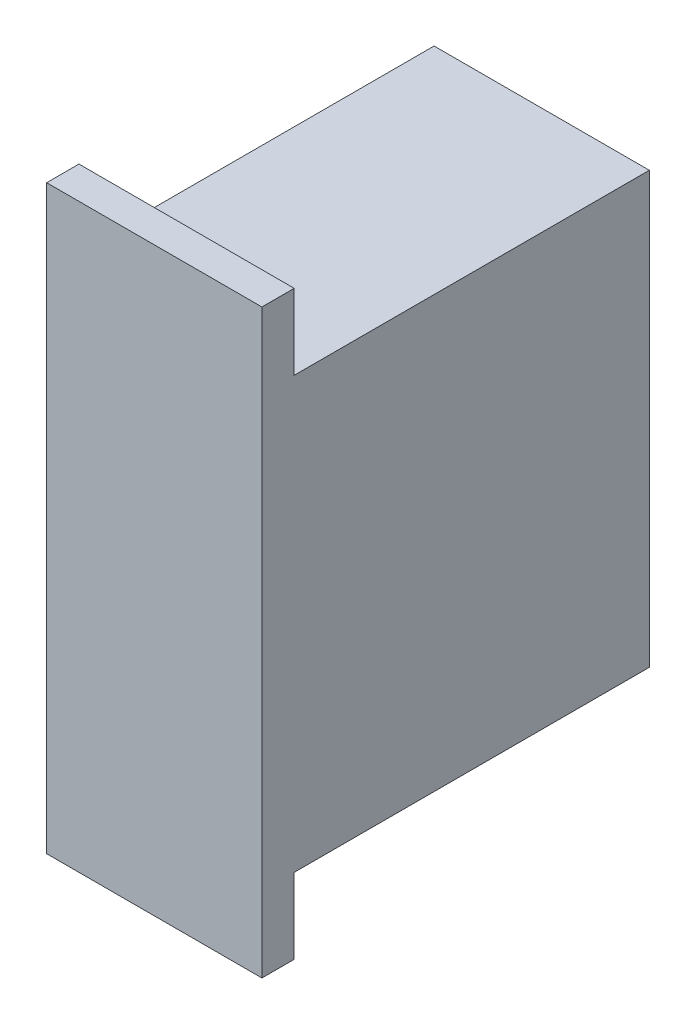
ISO-10303-21;
HEADER;
FILE_DESCRIPTION(('STEP AP214'),'2;1');
FILE_NAME('part.step','',(''),(''),'','','');
FILE_SCHEMA(('AUTOMOTIVE_DESIGN { 1 0 10303 214 1 1 1 1 }'));
ENDSEC;
DATA;
#1=APPLICATION_CONTEXT('core data for automotive mechanical design processes');
#2=APPLICATION_PROTOCOL_DEFINITION('international standard','automotive_design',2000,#1);
#3=PRODUCT_CONTEXT('',#1,'mechanical');
#4=PRODUCT('Part','Part','',(#3));
#5=PRODUCT_RELATED_PRODUCT_CATEGORY('part','',(#4));
#6=PRODUCT_DEFINITION_FORMATION('','',#4);
#7=PRODUCT_DEFINITION_CONTEXT('part definition',#1,'design');
#8=PRODUCT_DEFINITION('design','',#6,#7);
#9=PRODUCT_DEFINITION_SHAPE('','',#8);
#10=(LENGTH_UNIT() NAMED_UNIT(*) SI_UNIT(.MILLI.,.METRE.));
#11=(NAMED_UNIT(*) PLANE_ANGLE_UNIT() SI_UNIT($,.RADIAN.));
#12=(NAMED_UNIT(*) SI_UNIT($,.STERADIAN.) SOLID_ANGLE_UNIT());
#13=UNCERTAINTY_MEASURE_WITH_UNIT(LENGTH_MEASURE(1.E-05),#10,'distance_accuracy_value','');
#14=(GEOMETRIC_REPRESENTATION_CONTEXT(3) GLOBAL_UNCERTAINTY_ASSIGNED_CONTEXT((#13)) GLOBAL_UNIT_ASSIGNED_CONTEXT((#10,
#11,#12)) REPRESENTATION_CONTEXT('',''));
#15=CARTESIAN_POINT('',(0.,0.,0.));
#16=DIRECTION('',(0.,0.,1.));
#17=DIRECTION('',(1.,0.,0.));
#18=AXIS2_PLACEMENT_3D('',#15,#16,#17);
#19=CARTESIAN_POINT('',(9.99999999999999,-20.,36.));
#20=DIRECTION('',(-1.,0.,0.));
#21=DIRECTION('',(0.,0.,1.));
#22=AXIS2_PLACEMENT_3D('',#19,#20,#21);
#23=PLANE('',#22);
#24=DIRECTION('',(0.,1.,0.));
#25=VECTOR('',#24,1.);
#26=CARTESIAN_POINT('',(9.99999999999999,-20.,0.));
#27=LINE('',#26,#25);
#28=CARTESIAN_POINT('',(9.99999999999999,-20.,0.));
#29=VERTEX_POINT('',#28);
#30=CARTESIAN_POINT('',(9.99999999999999,20.,0.));
#31=VERTEX_POINT('',#30);
#32=EDGE_CURVE('E151',#29,#31,#27,.T.);
#33=ORIENTED_EDGE('',*,*,#32,.T.);
#34=DIRECTION('',(0.,0.,-1.));
#35=VECTOR('',#34,1.);
#36=CARTESIAN_POINT('',(9.99999999999999,20.,36.));
#37=LINE('',#36,#35);
#38=CARTESIAN_POINT('',(9.99999999999999,20.,33.));
#39=VERTEX_POINT('',#38);
#40=EDGE_CURVE('E11',#39,#31,#37,.T.);
#41=ORIENTED_EDGE('',*,*,#40,.F.);
#42=DIRECTION('',(0.,1.,0.));
#43=VECTOR('',#42,1.);
#44=CARTESIAN_POINT('',(9.99999999999999,20.,33.));
#45=LINE('',#44,#43);
#46=CARTESIAN_POINT('',(9.99999999999999,27.,33.));
#47=VERTEX_POINT('',#46);
#48=EDGE_CURVE('E62',#39,#47,#45,.T.);
#49=ORIENTED_EDGE('',*,*,#48,.T.);
#50=DIRECTION('',(0.,0.,1.));
#51=VECTOR('',#50,1.);
#52=CARTESIAN_POINT('',(9.99999999999999,27.,33.));
#53=LINE('',#52,#51);
#54=CARTESIAN_POINT('',(9.99999999999999,27.,36.));
#55=VERTEX_POINT('',#54);
#56=EDGE_CURVE('E110',#47,#55,#53,.T.);
#57=ORIENTED_EDGE('',*,*,#56,.T.);
#58=DIRECTION('',(0.,1.,0.));
#59=VECTOR('',#58,1.);
#60=CARTESIAN_POINT('',(9.99999999999999,-20.,36.));
#61=LINE('',#60,#59);
#62=CARTESIAN_POINT('',(9.99999999999999,-27.,36.));
#63=VERTEX_POINT('',#62);
#64=EDGE_CURVE('E105',#63,#55,#61,.T.);
#65=ORIENTED_EDGE('',*,*,#64,.F.);
#66=DIRECTION('',(0.,0.,1.));
#67=VECTOR('',#66,1.);
#68=CARTESIAN_POINT('',(9.99999999999999,-27.,33.));
#69=LINE('',#68,#67);
#70=CARTESIAN_POINT('',(9.99999999999999,-27.,33.));
#71=VERTEX_POINT('',#70);
#72=EDGE_CURVE('E108',#71,#63,#69,.T.);
#73=ORIENTED_EDGE('',*,*,#72,.F.);
#74=DIRECTION('',(0.,1.,0.));
#75=VECTOR('',#74,1.);
#76=CARTESIAN_POINT('',(9.99999999999999,-20.,33.));
#77=LINE('',#76,#75);
#78=CARTESIAN_POINT('',(9.99999999999999,-20.,33.));
#79=VERTEX_POINT('',#78);
#80=EDGE_CURVE('E137',#71,#79,#77,.T.);
#81=ORIENTED_EDGE('',*,*,#80,.T.);
#82=DIRECTION('',(0.,0.,-1.));
#83=VECTOR('',#82,1.);
#84=CARTESIAN_POINT('',(9.99999999999999,-20.,36.));
#85=LINE('',#84,#83);
#86=EDGE_CURVE('E154',#79,#29,#85,.T.);
#87=ORIENTED_EDGE('',*,*,#86,.T.);
#88=EDGE_LOOP('',(#33,#41,#49,#57,#65,#73,#81,#87));
#89=FACE_BOUND('',#88,.T.);
#90=ADVANCED_FACE('F40',(#89),#23,.F.);
#91=CARTESIAN_POINT('',(-10.,20.,36.));
#92=DIRECTION('',(0.,-1.,0.));
#93=DIRECTION('',(0.,0.,-1.));
#94=AXIS2_PLACEMENT_3D('',#91,#92,#93);
#95=PLANE('',#94);
#96=DIRECTION('',(0.,0.,-1.));
#97=VECTOR('',#96,1.);
#98=CARTESIAN_POINT('',(-10.,20.,36.));
#99=LINE('',#98,#97);
#100=CARTESIAN_POINT('',(-10.,20.,33.));
#101=VERTEX_POINT('',#100);
#102=CARTESIAN_POINT('',(-10.,20.,0.));
#103=VERTEX_POINT('',#102);
#104=EDGE_CURVE('E47',#101,#103,#99,.T.);
#105=ORIENTED_EDGE('',*,*,#104,.F.);
#106=DIRECTION('',(1.,0.,0.));
#107=VECTOR('',#106,1.);
#108=CARTESIAN_POINT('',(-10.,20.,33.));
#109=LINE('',#108,#107);
#110=EDGE_CURVE('E142',#101,#39,#109,.T.);
#111=ORIENTED_EDGE('',*,*,#110,.T.);
#112=ORIENTED_EDGE('',*,*,#40,.T.);
#113=DIRECTION('',(-1.,0.,0.));
#114=VECTOR('',#113,1.);
#115=CARTESIAN_POINT('',(-10.,20.,0.));
#116=LINE('',#115,#114);
#117=EDGE_CURVE('E156',#31,#103,#116,.T.);
#118=ORIENTED_EDGE('',*,*,#117,.T.);
#119=EDGE_LOOP('',(#105,#111,#112,#118));
#120=FACE_BOUND('',#119,.T.);
#121=ADVANCED_FACE('F175',(#120),#95,.F.);
#122=CARTESIAN_POINT('',(-10.,-20.,36.));
#123=DIRECTION('',(1.,0.,0.));
#124=DIRECTION('',(0.,0.,-1.));
#125=AXIS2_PLACEMENT_3D('',#122,#123,#124);
#126=PLANE('',#125);
#127=DIRECTION('',(0.,-1.,0.));
#128=VECTOR('',#127,1.);
#129=CARTESIAN_POINT('',(-10.,-20.,0.));
#130=LINE('',#129,#128);
#131=CARTESIAN_POINT('',(-10.,-20.,0.));
#132=VERTEX_POINT('',#131);
#133=EDGE_CURVE('E159',#103,#132,#130,.T.);
#134=ORIENTED_EDGE('',*,*,#133,.T.);
#135=DIRECTION('',(0.,0.,-1.));
#136=VECTOR('',#135,1.);
#137=CARTESIAN_POINT('',(-10.,-20.,36.));
#138=LINE('',#137,#136);
#139=CARTESIAN_POINT('',(-10.,-20.,33.));
#140=VERTEX_POINT('',#139);
#141=EDGE_CURVE('E165',#140,#132,#138,.T.);
#142=ORIENTED_EDGE('',*,*,#141,.F.);
#143=DIRECTION('',(0.,-1.,0.));
#144=VECTOR('',#143,1.);
#145=CARTESIAN_POINT('',(-10.,-20.,33.));
#146=LINE('',#145,#144);
#147=CARTESIAN_POINT('',(-10.,-27.,33.));
#148=VERTEX_POINT('',#147);
#149=EDGE_CURVE('E54',#140,#148,#146,.T.);
#150=ORIENTED_EDGE('',*,*,#149,.T.);
#151=DIRECTION('',(0.,0.,1.));
#152=VECTOR('',#151,1.);
#153=CARTESIAN_POINT('',(-10.,-27.,33.));
#154=LINE('',#153,#152);
#155=CARTESIAN_POINT('',(-10.,-27.,36.));
#156=VERTEX_POINT('',#155);
#157=EDGE_CURVE('E124',#148,#156,#154,.T.);
#158=ORIENTED_EDGE('',*,*,#157,.T.);
#159=DIRECTION('',(0.,-1.,0.));
#160=VECTOR('',#159,1.);
#161=CARTESIAN_POINT('',(-10.,-20.,36.));
#162=LINE('',#161,#160);
#163=CARTESIAN_POINT('',(-10.,27.,36.));
#164=VERTEX_POINT('',#163);
#165=EDGE_CURVE('E115',#164,#156,#162,.T.);
#166=ORIENTED_EDGE('',*,*,#165,.F.);
#167=DIRECTION('',(0.,0.,1.));
#168=VECTOR('',#167,1.);
#169=CARTESIAN_POINT('',(-10.,27.,33.));
#170=LINE('',#169,#168);
#171=CARTESIAN_POINT('',(-10.,27.,33.));
#172=VERTEX_POINT('',#171);
#173=EDGE_CURVE('E148',#172,#164,#170,.T.);
#174=ORIENTED_EDGE('',*,*,#173,.F.);
#175=DIRECTION('',(0.,-1.,0.));
#176=VECTOR('',#175,1.);
#177=CARTESIAN_POINT('',(-10.,20.,33.));
#178=LINE('',#177,#176);
#179=EDGE_CURVE('E130',#172,#101,#178,.T.);
#180=ORIENTED_EDGE('',*,*,#179,.T.);
#181=ORIENTED_EDGE('',*,*,#104,.T.);
#182=EDGE_LOOP('',(#134,#142,#150,#158,#166,#174,#180,#181));
#183=FACE_BOUND('',#182,.T.);
#184=ADVANCED_FACE('F168',(#183),#126,.F.);
#185=CARTESIAN_POINT('',(-10.,-20.,36.));
#186=DIRECTION('',(0.,1.,0.));
#187=DIRECTION('',(0.,0.,1.));
#188=AXIS2_PLACEMENT_3D('',#185,#186,#187);
#189=PLANE('',#188);
#190=ORIENTED_EDGE('',*,*,#86,.F.);
#191=DIRECTION('',(-1.,0.,0.));
#192=VECTOR('',#191,1.);
#193=CARTESIAN_POINT('',(-10.,-20.,33.));
#194=LINE('',#193,#192);
#195=EDGE_CURVE('E135',#79,#140,#194,.T.);
#196=ORIENTED_EDGE('',*,*,#195,.T.);
#197=ORIENTED_EDGE('',*,*,#141,.T.);
#198=DIRECTION('',(1.,0.,0.));
#199=VECTOR('',#198,1.);
#200=CARTESIAN_POINT('',(-10.,-20.,0.));
#201=LINE('',#200,#199);
#202=EDGE_CURVE('E116',#132,#29,#201,.T.);
#203=ORIENTED_EDGE('',*,*,#202,.T.);
#204=EDGE_LOOP('',(#190,#196,#197,#203));
#205=FACE_BOUND('',#204,.T.);
#206=ADVANCED_FACE('F182',(#205),#189,.F.);
#207=CARTESIAN_POINT('',(0.,0.,36.));
#208=DIRECTION('',(0.,0.,-1.));
#209=DIRECTION('',(-1.,0.,0.));
#210=AXIS2_PLACEMENT_3D('',#207,#208,#209);
#211=PLANE('',#210);
#212=ORIENTED_EDGE('',*,*,#64,.T.);
#213=DIRECTION('',(-1.,0.,0.));
#214=VECTOR('',#213,1.);
#215=CARTESIAN_POINT('',(-10.,27.,36.));
#216=LINE('',#215,#214);
#217=EDGE_CURVE('E128',#55,#164,#216,.T.);
#218=ORIENTED_EDGE('',*,*,#217,.T.);
#219=ORIENTED_EDGE('',*,*,#165,.T.);
#220=DIRECTION('',(1.,0.,0.));
#221=VECTOR('',#220,1.);
#222=CARTESIAN_POINT('',(-10.,-27.,36.));
#223=LINE('',#222,#221);
#224=EDGE_CURVE('E122',#156,#63,#223,.T.);
#225=ORIENTED_EDGE('',*,*,#224,.T.);
#226=EDGE_LOOP('',(#212,#218,#219,#225));
#227=FACE_BOUND('',#226,.T.);
#228=ADVANCED_FACE('F126',(#227),#211,.F.);
#229=CARTESIAN_POINT('',(0.,0.,0.));
#230=DIRECTION('',(0.,0.,-1.));
#231=DIRECTION('',(-1.,0.,0.));
#232=AXIS2_PLACEMENT_3D('',#229,#230,#231);
#233=PLANE('',#232);
#234=ORIENTED_EDGE('',*,*,#32,.F.);
#235=ORIENTED_EDGE('',*,*,#202,.F.);
#236=ORIENTED_EDGE('',*,*,#133,.F.);
#237=ORIENTED_EDGE('',*,*,#117,.F.);
#238=EDGE_LOOP('',(#234,#235,#236,#237));
#239=FACE_BOUND('',#238,.T.);
#240=ADVANCED_FACE('F179',(#239),#233,.T.);
#241=CARTESIAN_POINT('',(-10.,27.,33.));
#242=DIRECTION('',(0.,1.,0.));
#243=DIRECTION('',(0.,0.,1.));
#244=AXIS2_PLACEMENT_3D('',#241,#242,#243);
#245=PLANE('',#244);
#246=ORIENTED_EDGE('',*,*,#217,.F.);
#247=ORIENTED_EDGE('',*,*,#56,.F.);
#248=DIRECTION('',(-1.,0.,0.));
#249=VECTOR('',#248,1.);
#250=CARTESIAN_POINT('',(-10.,27.,33.));
#251=LINE('',#250,#249);
#252=EDGE_CURVE('E145',#47,#172,#251,.T.);
#253=ORIENTED_EDGE('',*,*,#252,.T.);
#254=ORIENTED_EDGE('',*,*,#173,.T.);
#255=EDGE_LOOP('',(#246,#247,#253,#254));
#256=FACE_BOUND('',#255,.T.);
#257=ADVANCED_FACE('F186',(#256),#245,.T.);
#258=CARTESIAN_POINT('',(0.,0.,33.));
#259=DIRECTION('',(0.,0.,-1.));
#260=DIRECTION('',(-1.,0.,0.));
#261=AXIS2_PLACEMENT_3D('',#258,#259,#260);
#262=PLANE('',#261);
#263=ORIENTED_EDGE('',*,*,#179,.F.);
#264=ORIENTED_EDGE('',*,*,#252,.F.);
#265=ORIENTED_EDGE('',*,*,#48,.F.);
#266=ORIENTED_EDGE('',*,*,#110,.F.);
#267=EDGE_LOOP('',(#263,#264,#265,#266));
#268=FACE_BOUND('',#267,.T.);
#269=ADVANCED_FACE('F184',(#268),#262,.T.);
#270=CARTESIAN_POINT('',(-10.,-27.,33.));
#271=DIRECTION('',(0.,-1.,0.));
#272=DIRECTION('',(0.,0.,-1.));
#273=AXIS2_PLACEMENT_3D('',#270,#271,#272);
#274=PLANE('',#273);
#275=ORIENTED_EDGE('',*,*,#224,.F.);
#276=ORIENTED_EDGE('',*,*,#157,.F.);
#277=DIRECTION('',(1.,0.,0.));
#278=VECTOR('',#277,1.);
#279=CARTESIAN_POINT('',(-10.,-27.,33.));
#280=LINE('',#279,#278);
#281=EDGE_CURVE('E123',#148,#71,#280,.T.);
#282=ORIENTED_EDGE('',*,*,#281,.T.);
#283=ORIENTED_EDGE('',*,*,#72,.T.);
#284=EDGE_LOOP('',(#275,#276,#282,#283));
#285=FACE_BOUND('',#284,.T.);
#286=ADVANCED_FACE('F121',(#285),#274,.T.);
#287=CARTESIAN_POINT('',(0.,0.,33.));
#288=DIRECTION('',(0.,0.,1.));
#289=DIRECTION('',(1.,0.,0.));
#290=AXIS2_PLACEMENT_3D('',#287,#288,#289);
#291=PLANE('',#290);
#292=ORIENTED_EDGE('',*,*,#149,.F.);
#293=ORIENTED_EDGE('',*,*,#195,.F.);
#294=ORIENTED_EDGE('',*,*,#80,.F.);
#295=ORIENTED_EDGE('',*,*,#281,.F.);
#296=EDGE_LOOP('',(#292,#293,#294,#295));
#297=FACE_BOUND('',#296,.T.);
#298=ADVANCED_FACE('F183',(#297),#291,.F.);
#299=CLOSED_SHELL('',(#90,#121,#184,#206,#228,#240,#257,#269,#286,#298));
#300=MANIFOLD_SOLID_BREP('B2',#299);
#301=ADVANCED_BREP_SHAPE_REPRESENTATION('',(#18,#300),#14);
#302=SHAPE_DEFINITION_REPRESENTATION(#9,#301);
ENDSEC;
END-ISO-10303-21;
